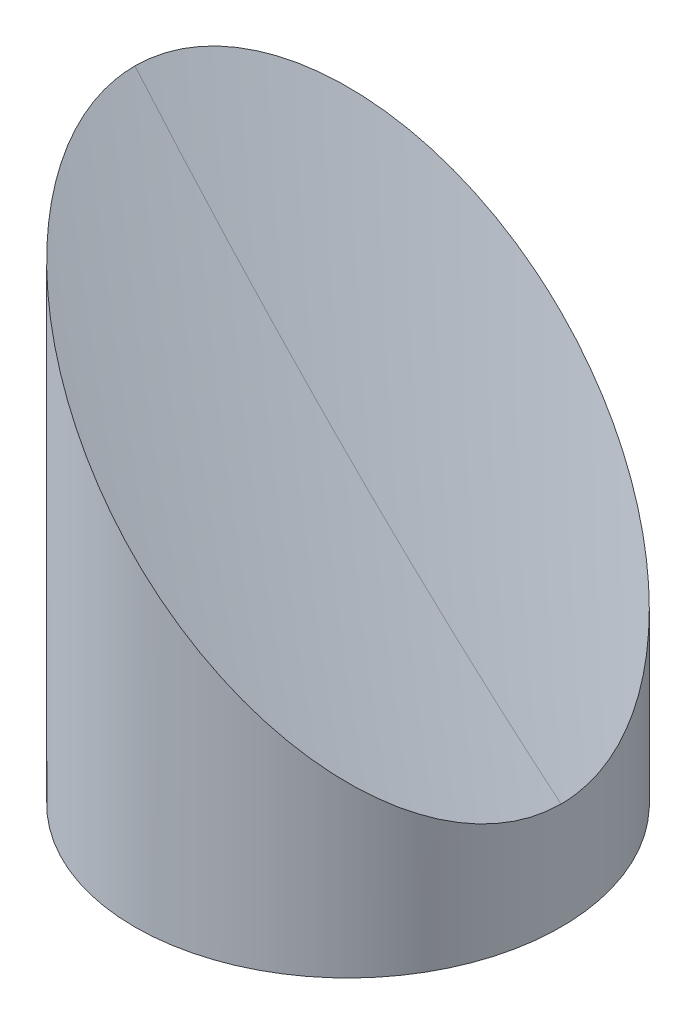
ISO-10303-21;
HEADER;
FILE_DESCRIPTION(('STEP AP214'),'2;1');
FILE_NAME('part.step','',(''),(''),'','','');
FILE_SCHEMA(('AUTOMOTIVE_DESIGN { 1 0 10303 214 1 1 1 1 }'));
ENDSEC;
DATA;
#1=APPLICATION_CONTEXT('core data for automotive mechanical design processes');
#2=APPLICATION_PROTOCOL_DEFINITION('international standard','automotive_design',2000,#1);
#3=PRODUCT_CONTEXT('',#1,'mechanical');
#4=PRODUCT('Part','Part','',(#3));
#5=PRODUCT_RELATED_PRODUCT_CATEGORY('part','',(#4));
#6=PRODUCT_DEFINITION_FORMATION('','',#4);
#7=PRODUCT_DEFINITION_CONTEXT('part definition',#1,'design');
#8=PRODUCT_DEFINITION('design','',#6,#7);
#9=PRODUCT_DEFINITION_SHAPE('','',#8);
#10=(LENGTH_UNIT() NAMED_UNIT(*) SI_UNIT(.MILLI.,.METRE.));
#11=(NAMED_UNIT(*) PLANE_ANGLE_UNIT() SI_UNIT($,.RADIAN.));
#12=(NAMED_UNIT(*) SI_UNIT($,.STERADIAN.) SOLID_ANGLE_UNIT());
#13=UNCERTAINTY_MEASURE_WITH_UNIT(LENGTH_MEASURE(1.E-05),#10,'distance_accuracy_value','');
#14=(GEOMETRIC_REPRESENTATION_CONTEXT(3) GLOBAL_UNCERTAINTY_ASSIGNED_CONTEXT((#13)) GLOBAL_UNIT_ASSIGNED_CONTEXT((#10,
#11,#12)) REPRESENTATION_CONTEXT('',''));
#15=CARTESIAN_POINT('',(0.,0.,0.));
#16=DIRECTION('',(0.,0.,1.));
#17=DIRECTION('',(1.,0.,0.));
#18=AXIS2_PLACEMENT_3D('',#15,#16,#17);
#19=CARTESIAN_POINT('',(9.525,4.32,0.));
#20=DIRECTION('',(0.,1.,0.));
#21=DIRECTION('',(0.,0.,1.));
#22=AXIS2_PLACEMENT_3D('',#19,#20,#21);
#23=PLANE('',#22);
#24=CARTESIAN_POINT('',(9.525,4.32,0.));
#25=DIRECTION('',(0.,-1.,0.));
#26=DIRECTION('',(0.,0.,-1.));
#27=AXIS2_PLACEMENT_3D('',#24,#25,#26);
#28=CIRCLE('',#27,1.594);
#29=CARTESIAN_POINT('',(9.525,4.32,-1.594));
#30=VERTEX_POINT('',#29);
#31=EDGE_CURVE('E20',#30,#30,#28,.T.);
#32=ORIENTED_EDGE('',*,*,#31,.T.);
#33=EDGE_LOOP('',(#32));
#34=FACE_BOUND('',#33,.T.);
#35=ADVANCED_FACE('F17',(#34),#23,.F.);
#36=CARTESIAN_POINT('',(0.,4.32,0.));
#37=DIRECTION('',(0.,1.,0.));
#38=DIRECTION('',(0.,0.,1.));
#39=AXIS2_PLACEMENT_3D('',#36,#37,#38);
#40=PLANE('',#39);
#41=CARTESIAN_POINT('',(0.,4.32,0.));
#42=DIRECTION('',(0.,-1.,0.));
#43=DIRECTION('',(0.,0.,-1.));
#44=AXIS2_PLACEMENT_3D('',#41,#42,#43);
#45=CIRCLE('',#44,1.594);
#46=CARTESIAN_POINT('',(0.,4.32,-1.594));
#47=VERTEX_POINT('',#46);
#48=EDGE_CURVE('E65',#47,#47,#45,.T.);
#49=ORIENTED_EDGE('',*,*,#48,.T.);
#50=EDGE_LOOP('',(#49));
#51=FACE_BOUND('',#50,.T.);
#52=ADVANCED_FACE('F129',(#51),#40,.F.);
#53=CARTESIAN_POINT('',(-9.525,6.1699999999405,0.));
#54=DIRECTION('',(0.,-1.,0.));
#55=DIRECTION('',(0.,0.,-1.));
#56=AXIS2_PLACEMENT_3D('',#53,#54,#55);
#57=CONICAL_SURFACE('',#56,1.35255000014922,1.02974425866422);
#58=CARTESIAN_POINT('',(-9.525,6.98269403028462,0.));
#59=VERTEX_POINT('',#58);
#60=VERTEX_LOOP('',#59);
#61=FACE_BOUND('',#60,.T.);
#62=CARTESIAN_POINT('',(-9.525,6.17,0.));
#63=DIRECTION('',(0.,-1.,0.));
#64=DIRECTION('',(0.,0.,-1.));
#65=AXIS2_PLACEMENT_3D('',#62,#63,#64);
#66=CIRCLE('',#65,1.35255);
#67=CARTESIAN_POINT('',(-9.525,6.17,-1.35255));
#68=VERTEX_POINT('',#67);
#69=EDGE_CURVE('E59',#68,#68,#66,.T.);
#70=ORIENTED_EDGE('',*,*,#69,.T.);
#71=EDGE_LOOP('',(#70));
#72=FACE_BOUND('',#71,.T.);
#73=ADVANCED_FACE('F126',(#61,#72),#57,.F.);
#74=CARTESIAN_POINT('',(4.76250000000001,6.17000000005419,8.24889197104677));
#75=DIRECTION('',(0.,-1.,0.));
#76=DIRECTION('',(0.,0.,-1.));
#77=AXIS2_PLACEMENT_3D('',#74,#75,#76);
#78=CONICAL_SURFACE('',#77,1.35254999986183,1.02974425844574);
#79=CARTESIAN_POINT('',(4.76250000000001,6.98269403039831,8.24889197113204));
#80=VERTEX_POINT('',#79);
#81=VERTEX_LOOP('',#80);
#82=FACE_BOUND('',#81,.T.);
#83=CARTESIAN_POINT('',(4.76250000000001,6.17,8.24889197104677));
#84=DIRECTION('',(0.,-1.,0.));
#85=DIRECTION('',(0.,0.,-1.));
#86=AXIS2_PLACEMENT_3D('',#83,#84,#85);
#87=CIRCLE('',#86,1.35255);
#88=CARTESIAN_POINT('',(4.76250000000001,6.17,6.89634197104677));
#89=VERTEX_POINT('',#88);
#90=EDGE_CURVE('E54',#89,#89,#87,.T.);
#91=ORIENTED_EDGE('',*,*,#90,.T.);
#92=EDGE_LOOP('',(#91));
#93=FACE_BOUND('',#92,.T.);
#94=ADVANCED_FACE('F48',(#82,#93),#78,.F.);
#95=CARTESIAN_POINT('',(4.76250000000001,6.16999999999734,-8.24889197104677));
#96=DIRECTION('',(0.,-1.,0.));
#97=DIRECTION('',(1.,0.,0.));
#98=AXIS2_PLACEMENT_3D('',#95,#96,#97);
#99=CONICAL_SURFACE('',#98,1.35254999992502,1.02974425866409);
#100=CARTESIAN_POINT('',(4.76250000000001,6.98269403019935,-8.24889197110362));
#101=VERTEX_POINT('',#100);
#102=VERTEX_LOOP('',#101);
#103=FACE_BOUND('',#102,.T.);
#104=CARTESIAN_POINT('',(4.76250000000001,6.17,-8.24889197104677));
#105=DIRECTION('',(0.,-1.,0.));
#106=DIRECTION('',(0.,0.,-1.));
#107=AXIS2_PLACEMENT_3D('',#104,#105,#106);
#108=CIRCLE('',#107,1.35255);
#109=CARTESIAN_POINT('',(4.76250000000001,6.17,-9.60144197104677));
#110=VERTEX_POINT('',#109);
#111=EDGE_CURVE('E52',#110,#110,#108,.T.);
#112=ORIENTED_EDGE('',*,*,#111,.T.);
#113=EDGE_LOOP('',(#112));
#114=FACE_BOUND('',#113,.T.);
#115=ADVANCED_FACE('F44',(#103,#114),#99,.F.);
#116=CARTESIAN_POINT('',(9.525,0.,0.));
#117=DIRECTION('',(0.,-1.,0.));
#118=DIRECTION('',(0.,0.,-1.));
#119=AXIS2_PLACEMENT_3D('',#116,#117,#118);
#120=CYLINDRICAL_SURFACE('',#119,1.594);
#121=ORIENTED_EDGE('',*,*,#31,.F.);
#122=EDGE_LOOP('',(#121));
#123=FACE_BOUND('',#122,.T.);
#124=CARTESIAN_POINT('',(9.525,0.,0.));
#125=DIRECTION('',(0.,-1.,0.));
#126=DIRECTION('',(0.,0.,-1.));
#127=AXIS2_PLACEMENT_3D('',#124,#125,#126);
#128=CIRCLE('',#127,1.594);
#129=CARTESIAN_POINT('',(9.525,0.,-1.594));
#130=VERTEX_POINT('',#129);
#131=EDGE_CURVE('E56',#130,#130,#128,.T.);
#132=ORIENTED_EDGE('',*,*,#131,.T.);
#133=EDGE_LOOP('',(#132));
#134=FACE_BOUND('',#133,.T.);
#135=ADVANCED_FACE('F47',(#123,#134),#120,.F.);
#136=CARTESIAN_POINT('',(0.,0.,0.));
#137=DIRECTION('',(0.,-1.,0.));
#138=DIRECTION('',(0.,0.,-1.));
#139=AXIS2_PLACEMENT_3D('',#136,#137,#138);
#140=CYLINDRICAL_SURFACE('',#139,1.594);
#141=ORIENTED_EDGE('',*,*,#48,.F.);
#142=EDGE_LOOP('',(#141));
#143=FACE_BOUND('',#142,.T.);
#144=CARTESIAN_POINT('',(0.,0.,0.));
#145=DIRECTION('',(0.,-1.,0.));
#146=DIRECTION('',(0.,0.,-1.));
#147=AXIS2_PLACEMENT_3D('',#144,#145,#146);
#148=CIRCLE('',#147,1.594);
#149=CARTESIAN_POINT('',(0.,0.,-1.594));
#150=VERTEX_POINT('',#149);
#151=EDGE_CURVE('E164',#150,#150,#148,.T.);
#152=ORIENTED_EDGE('',*,*,#151,.T.);
#153=EDGE_LOOP('',(#152));
#154=FACE_BOUND('',#153,.T.);
#155=ADVANCED_FACE('F116',(#143,#154),#140,.F.);
#156=CARTESIAN_POINT('',(-9.525,0.,0.));
#157=DIRECTION('',(0.,-1.,0.));
#158=DIRECTION('',(0.,0.,-1.));
#159=AXIS2_PLACEMENT_3D('',#156,#157,#158);
#160=CYLINDRICAL_SURFACE('',#159,1.35255);
#161=ORIENTED_EDGE('',*,*,#69,.F.);
#162=EDGE_LOOP('',(#161));
#163=FACE_BOUND('',#162,.T.);
#164=CARTESIAN_POINT('',(-9.525,0.,0.));
#165=DIRECTION('',(0.,-1.,0.));
#166=DIRECTION('',(0.,0.,-1.));
#167=AXIS2_PLACEMENT_3D('',#164,#165,#166);
#168=CIRCLE('',#167,1.35255);
#169=CARTESIAN_POINT('',(-9.525,0.,-1.35255));
#170=VERTEX_POINT('',#169);
#171=EDGE_CURVE('E160',#170,#170,#168,.T.);
#172=ORIENTED_EDGE('',*,*,#171,.T.);
#173=EDGE_LOOP('',(#172));
#174=FACE_BOUND('',#173,.T.);
#175=ADVANCED_FACE('F112',(#163,#174),#160,.F.);
#176=CARTESIAN_POINT('',(4.76250000000001,0.,8.24889197104677));
#177=DIRECTION('',(0.,-1.,0.));
#178=DIRECTION('',(0.,0.,-1.));
#179=AXIS2_PLACEMENT_3D('',#176,#177,#178);
#180=CYLINDRICAL_SURFACE('',#179,1.35255);
#181=ORIENTED_EDGE('',*,*,#90,.F.);
#182=EDGE_LOOP('',(#181));
#183=FACE_BOUND('',#182,.T.);
#184=CARTESIAN_POINT('',(4.76250000000001,0.,8.24889197104677));
#185=DIRECTION('',(0.,-1.,0.));
#186=DIRECTION('',(0.,0.,-1.));
#187=AXIS2_PLACEMENT_3D('',#184,#185,#186);
#188=CIRCLE('',#187,1.35255);
#189=CARTESIAN_POINT('',(4.76250000000001,0.,6.89634197104677));
#190=VERTEX_POINT('',#189);
#191=EDGE_CURVE('E156',#190,#190,#188,.T.);
#192=ORIENTED_EDGE('',*,*,#191,.T.);
#193=EDGE_LOOP('',(#192));
#194=FACE_BOUND('',#193,.T.);
#195=ADVANCED_FACE('F109',(#183,#194),#180,.F.);
#196=CARTESIAN_POINT('',(4.76250000000001,0.,-8.24889197104677));
#197=DIRECTION('',(0.,-1.,0.));
#198=DIRECTION('',(0.,0.,-1.));
#199=AXIS2_PLACEMENT_3D('',#196,#197,#198);
#200=CYLINDRICAL_SURFACE('',#199,1.35255);
#201=ORIENTED_EDGE('',*,*,#111,.F.);
#202=EDGE_LOOP('',(#201));
#203=FACE_BOUND('',#202,.T.);
#204=CARTESIAN_POINT('',(4.76250000000001,0.,-8.24889197104677));
#205=DIRECTION('',(0.,-1.,0.));
#206=DIRECTION('',(0.,0.,-1.));
#207=AXIS2_PLACEMENT_3D('',#204,#205,#206);
#208=CIRCLE('',#207,1.35255);
#209=CARTESIAN_POINT('',(4.76250000000001,0.,-9.60144197104677));
#210=VERTEX_POINT('',#209);
#211=EDGE_CURVE('E152',#210,#210,#208,.T.);
#212=ORIENTED_EDGE('',*,*,#211,.T.);
#213=EDGE_LOOP('',(#212));
#214=FACE_BOUND('',#213,.T.);
#215=ADVANCED_FACE('F101',(#203,#214),#200,.F.);
#216=CARTESIAN_POINT('',(-11.537222945202,31.9279524000273,15.2482672990668));
#217=CARTESIAN_POINT('',(-12.4129239047402,31.9279524000273,10.209559043668));
#218=CARTESIAN_POINT('',(-12.8523999999994,31.9279524000273,5.1142382671853));
#219=CARTESIAN_POINT('',(-12.8523999999993,31.9279524000273,-1.74339709335669E-12));
#220=CARTESIAN_POINT('',(1.12536542053467,16.9077809333549,13.0475761258415));
#221=CARTESIAN_POINT('',(0.376049140268043,16.9077809333549,8.73607448117627));
#222=CARTESIAN_POINT('',(6.92575027709755E-13,16.9077809333549,4.37613086182429));
#223=CARTESIAN_POINT('',(7.7715611723761E-13,16.9077809333549,-1.47278023110431E-12));
#224=CARTESIAN_POINT('',(13.7879537862713,6.22315240001751,10.8468849526163));
#225=CARTESIAN_POINT('',(13.1650221852763,6.22315240001751,7.26258991868454));
#226=CARTESIAN_POINT('',(12.8524000000007,6.22315240001751,3.63802345646327));
#227=CARTESIAN_POINT('',(12.8524000000008,6.22315240001751,-1.20216336885193E-12));
#228=(BOUNDED_SURFACE() B_SPLINE_SURFACE(2,3,((#216,#217,#218,#219),(#220,#221,#222,#223),(#224,
#225,#226,#227)),.UNSPECIFIED.,.F.,.F.,.F.) B_SPLINE_SURFACE_WITH_KNOTS((3,3),(4,4),
(0.496393190962452,0.497434289292743),(0.,1.),
.UNSPECIFIED.) GEOMETRIC_REPRESENTATION_ITEM() RATIONAL_B_SPLINE_SURFACE(((1.,0.997534009991186,
0.997534009991186,1.),(1.,0.997534009991186,0.997534009991186,1.),(1.,0.997534009991186,
0.997534009991186,1.))) REPRESENTATION_ITEM('') SURFACE());
#229=CARTESIAN_POINT('',(12.7000000000003,6.35000000001804,-2.40918709652745E-13));
#230=CARTESIAN_POINT('',(12.7000017011063,6.34999829939632,0.135684319517376));
#231=CARTESIAN_POINT('',(12.697824968645,6.35217503169324,0.271349485597933));
#232=CARTESIAN_POINT('',(12.6891366451376,6.3608633545507,0.542394958756967));
#233=CARTESIAN_POINT('',(12.6826252808029,6.36737471839975,0.677775280362013));
#234=CARTESIAN_POINT('',(12.656637226705,6.3933627720219,1.0829016606215));
#235=CARTESIAN_POINT('',(12.6307064947289,6.41929350498668,1.35187379328934));
#236=CARTESIAN_POINT('',(12.5623957304711,6.48760426984755,1.88349381224683));
#237=CARTESIAN_POINT('',(12.5201386476142,6.52986135232896,2.14617374181082));
#238=CARTESIAN_POINT('',(12.4199443961709,6.63005560358886,2.66550556707158));
#239=CARTESIAN_POINT('',(12.3620053417748,6.68799465817719,2.92215673375275));
#240=CARTESIAN_POINT('',(12.2316136459628,6.8183863541204,3.42716649719638));
#241=CARTESIAN_POINT('',(12.159200267214,6.89079973280888,3.67554545139419));
#242=CARTESIAN_POINT('',(12.0008408041084,7.04915919587864,4.16361365220217));
#243=CARTESIAN_POINT('',(11.9148891545327,7.13511084547886,4.40329927514793));
#244=CARTESIAN_POINT('',(11.7305003051669,7.31949969485869,4.87331419404003));
#245=CARTESIAN_POINT('',(11.6320443778909,7.41795562212416,5.10362875746726));
#246=CARTESIAN_POINT('',(11.423909349768,7.62609065024283,5.55390368303917));
#247=CARTESIAN_POINT('',(11.3142277619288,7.73577223808837,5.77386173491965));
#248=CARTESIAN_POINT('',(11.0342510430316,8.01574895699008,6.29746576760374));
#249=CARTESIAN_POINT('',(10.8585266090112,8.19147339100403,6.59533128151021));
#250=CARTESIAN_POINT('',(10.4892616079405,8.5607383920744,7.1680962824348));
#251=CARTESIAN_POINT('',(10.2957146646945,8.75428533532638,7.44298748252382));
#252=CARTESIAN_POINT('',(9.8932554571608,9.15674454285682,7.97017201462246));
#253=CARTESIAN_POINT('',(9.68431845608143,9.36568154392686,8.2224274538794));
#254=CARTESIAN_POINT('',(9.25376422005097,9.79623577995811,8.70415000742102));
#255=CARTESIAN_POINT('',(9.03214676471743,10.0178532353017,8.93361672545493));
#256=CARTESIAN_POINT('',(8.49068987777977,10.5593101222401,9.45455770225708));
#257=CARTESIAN_POINT('',(8.1659262214975,10.8840737785039,9.73582571165568));
#258=CARTESIAN_POINT('',(7.5003271598768,11.5496728401282,10.257385762454));
#259=CARTESIAN_POINT('',(7.15948560868818,11.890514391339,10.4976619698436));
#260=CARTESIAN_POINT('',(6.46518056264116,12.5848194373727,10.9389532419134));
#261=CARTESIAN_POINT('',(6.11171110166377,12.9382888983146,11.1399494504807));
#262=CARTESIAN_POINT('',(5.3952345420147,13.6547654579627,11.504038757329));
#263=CARTESIAN_POINT('',(5.03222836458131,14.0177716354306,11.6671355017888));
#264=CARTESIAN_POINT('',(4.28669922301091,14.7633007770202,11.9616131681826));
#265=CARTESIAN_POINT('',(3.90393028813246,15.1460697118816,12.0917445377867));
#266=CARTESIAN_POINT('',(3.13294073117828,15.9170592688312,12.3140426090714));
#267=CARTESIAN_POINT('',(2.74471999432213,16.3052800056997,12.4062085101967));
#268=CARTESIAN_POINT('',(1.96461579671055,17.0853842033122,12.5534019921638));
#269=CARTESIAN_POINT('',(1.57273084382357,17.4772691561876,12.6084137100659));
#270=CARTESIAN_POINT('',(0.78724061146337,18.2627593885558,12.6817135085025));
#271=CARTESIAN_POINT('',(0.393635201146762,18.6563647988919,12.6999987454611));
#272=CARTESIAN_POINT('',(-0.488910704372117,19.5389107043762,12.7000015581876));
#273=CARTESIAN_POINT('',(-0.977867365975158,20.0278673659062,12.6717970820766));
#274=CARTESIAN_POINT('',(-1.95261147378495,21.002611473727,12.5585872548674));
#275=CARTESIAN_POINT('',(-2.43839806163658,21.4883980616626,12.4735671157922));
#276=CARTESIAN_POINT('',(-3.40301609320207,22.4530160932247,12.2456133050626));
#277=CARTESIAN_POINT('',(-3.8818496011307,22.931849601066,12.1026972012472));
#278=CARTESIAN_POINT('',(-4.82852880764529,23.8785288075746,11.7570871237906));
#279=CARTESIAN_POINT('',(-5.29637916798144,24.3463791679921,11.5544190256643));
#280=CARTESIAN_POINT('',(-6.07820209930185,25.1282020993377,11.1568751475923));
#281=CARTESIAN_POINT('',(-6.39624295533966,25.4462429553532,10.9778914974675));
#282=CARTESIAN_POINT('',(-7.02251406233006,26.0725140623369,10.5882152467273));
#283=CARTESIAN_POINT('',(-7.33074470837117,26.3807447083936,10.3775239250438));
#284=CARTESIAN_POINT('',(-7.93448131571373,26.9844813157437,9.92353207290696));
#285=CARTESIAN_POINT('',(-8.23000339458917,27.2800033946111,9.68027455862056));
#286=CARTESIAN_POINT('',(-8.80567016334975,27.8556701633704,9.15973145153569));
#287=CARTESIAN_POINT('',(-9.08581930748704,28.1358193075143,8.88245579152337));
#288=CARTESIAN_POINT('',(-9.55687233925901,28.6068723392853,8.3692340801179));
#289=CARTESIAN_POINT('',(-9.75209276754894,28.8020927675709,8.14119328334526));
#290=CARTESIAN_POINT('',(-10.1302585965249,29.1802585965475,7.66551745095414));
#291=CARTESIAN_POINT('',(-10.3132045823595,29.3632045823869,7.41788335061793));
#292=CARTESIAN_POINT('',(-10.6645907690619,29.714590769089,6.90315370175983));
#293=CARTESIAN_POINT('',(-10.8330427331089,29.8830427331308,6.63607426617485));
#294=CARTESIAN_POINT('',(-11.1532332972319,30.203233297256,6.08256034394121));
#295=CARTESIAN_POINT('',(-11.3049757465951,30.3549757466264,5.79613033962069));
#296=CARTESIAN_POINT('',(-11.5604367059042,30.6104367059284,5.26448896252024));
#297=CARTESIAN_POINT('',(-11.6676635062465,30.7176635062603,5.02264366231438));
#298=CARTESIAN_POINT('',(-11.8684313393875,30.9184313394032,4.5278662420888));
#299=CARTESIAN_POINT('',(-11.9619755017789,31.0119755018068,4.27493667459826));
#300=CARTESIAN_POINT('',(-12.1338392171315,31.1838392171593,3.75947140966074));
#301=CARTESIAN_POINT('',(-12.2121860834215,31.2621860834371,3.49695397264084));
#302=CARTESIAN_POINT('',(-12.3525206132004,31.4025206132168,2.96332349313227));
#303=CARTESIAN_POINT('',(-12.4145121818311,31.4645121818606,2.69221251986443));
#304=CARTESIAN_POINT('',(-12.5058242477392,31.5558242477655,2.22135360234005));
#305=CARTESIAN_POINT('',(-12.5394220647089,31.5894220647263,2.02324625351194));
#306=CARTESIAN_POINT('',(-12.5973040144483,31.6473040144719,1.62435597620031));
#307=CARTESIAN_POINT('',(-12.6215901722825,31.6715901723212,1.42357363930254));
#308=CARTESIAN_POINT('',(-12.660643439706,31.7106434397234,1.01951125328955));
#309=CARTESIAN_POINT('',(-12.6753799408538,31.7253799408346,0.816225280214549));
#310=CARTESIAN_POINT('',(-12.6950699881426,31.7450699880922,0.408630021814922));
#311=CARTESIAN_POINT('',(-12.700019723441,31.7500197233958,0.204320368914465));
#312=CARTESIAN_POINT('',(-12.7000000000001,31.7500000000282,-1.12274406267449E-12));
#313=B_SPLINE_CURVE_WITH_KNOTS('',3,(#229,#230,#231,#232,#233,#234,#235,#236,#237,#238,#239,
#240,#241,#242,#243,#244,#245,#246,#247,#248,#249,#250,#251,#252,#253,#254,#255,#256,#257,#258,
#259,#260,#261,#262,#263,#264,#265,#266,#267,#268,#269,#270,#271,#272,#273,#274,#275,#276,#277,
#278,#279,#280,#281,#282,#283,#284,#285,#286,#287,#288,#289,#290,#291,#292,#293,#294,#295,#296,
#297,#298,#299,#300,#301,#302,#303,#304,#305,#306,#307,#308,#309,#310,#311,#312),.UNSPECIFIED.,
.F.,.F.,(4,2,2,2,2,2,2,2,2,2,2,2,2,2,2,2,2,2,2,2,2,2,2,2,2,2,2,2,2,2,2,2,2,2,2,2,2,2,2,2,2,4),
(0.,0.406980210497207,0.813939136638885,1.62713767851625,2.43432798932028,3.24161541063028,
4.04674201844721,4.85220046009061,5.65887977450513,6.46573819338188,7.6277558241921,
8.79019080663074,9.95453677773315,11.1189029909644,12.7322240661567,14.3461669189897,
15.9608826418714,17.5754429540626,19.2442438285103,20.9130798901659,22.5826280099686,
24.252305390825,26.3261116509384,28.4004578915488,30.4741751674738,32.5469957388624,
33.9981578300885,35.4492614042355,36.8984668098576,38.3472500719078,39.420661205837,
40.4940211315864,41.5665015483373,42.6387343840035,43.4943078929027,44.3496854017472,
45.203511042973,46.0571326320233,46.667903129417,47.2785407233074,47.8911259695614,
48.5039497018188),.UNSPECIFIED.);
#314=CARTESIAN_POINT('',(12.7,6.35000000001804,-1.20459354826373E-13));
#315=VERTEX_POINT('',#314);
#316=CARTESIAN_POINT('',(-12.7000000000001,31.7500000000274,-5.5029975141369E-13));
#317=VERTEX_POINT('',#316);
#318=EDGE_CURVE('E74',#315,#317,#313,.T.);
#319=CARTESIAN_POINT('',(-12.8523999999999,31.9279524000273,0.));
#320=CARTESIAN_POINT('',(1.59594559789866E-13,16.9077809333549,0.));
#321=CARTESIAN_POINT('',(12.8524000000002,6.22315240001751,0.));
#322=B_SPLINE_CURVE_WITH_KNOTS('',2,(#319,#320,#321),.UNSPECIFIED.,.F.,.F.,(3,3),
(0.496393190962452,0.497434289292743),.UNSPECIFIED.);
#323=EDGE_CURVE('E32',#317,#315,#322,.T.);
#324=ORIENTED_EDGE('',*,*,#318,.F.);
#325=ORIENTED_EDGE('',*,*,#323,.F.);
#326=EDGE_LOOP('',(#324,#325));
#327=FACE_BOUND('',#326,.T.);
#328=ADVANCED_FACE('F89',(#327),#228,.T.);
#329=CARTESIAN_POINT('',(-12.8523999999999,31.9279524000273,0.));
#330=CARTESIAN_POINT('',(-12.8523999999999,31.9279524000273,-5.08264990810657));
#331=CARTESIAN_POINT('',(-12.4183228585521,31.9279524000273,-10.1467299947213));
#332=CARTESIAN_POINT('',(-11.5533404388287,31.9279524000273,-15.1552363091773));
#333=CARTESIAN_POINT('',(-11.5403239884121,31.9279524000273,-15.2306054411007));
#334=CARTESIAN_POINT('',(-11.5273075379955,31.9279524000273,-15.305974573024));
#335=CARTESIAN_POINT('',(-11.5142910875788,31.9279524000273,-15.3813437049474));
#336=CARTESIAN_POINT('',(1.59594559789866E-13,16.9077809333549,0.));
#337=CARTESIAN_POINT('',(1.59594559789866E-13,16.9077809333549,-4.34910146158577));
#338=CARTESIAN_POINT('',(0.371429385152286,16.9077809333549,-8.68231317289333));
#339=CARTESIAN_POINT('',(1.11157406831547,16.9077809333549,-12.9679717420228));
#340=CARTESIAN_POINT('',(1.12271193233426,16.9077809333549,-13.0324632981466));
#341=CARTESIAN_POINT('',(1.13384979635306,16.9077809333549,-13.0969548542704));
#342=CARTESIAN_POINT('',(1.14498766037186,16.9077809333549,-13.1614464103942));
#343=CARTESIAN_POINT('',(12.8524000000002,6.22315240001751,0.));
#344=CARTESIAN_POINT('',(12.8524000000002,6.22315240001751,-3.61555301506497));
#345=CARTESIAN_POINT('',(13.1611816288567,6.22315240001751,-7.21789635106532));
#346=CARTESIAN_POINT('',(13.7764885754597,6.22315240001751,-10.7807071748683));
#347=CARTESIAN_POINT('',(13.7857478530806,6.22315240001751,-10.8343211551925));
#348=CARTESIAN_POINT('',(13.7950071307016,6.22315240001751,-10.8879351355168));
#349=CARTESIAN_POINT('',(13.8042664083225,6.22315240001751,-10.941549115841));
#350=(BOUNDED_SURFACE() B_SPLINE_SURFACE(2,3,((#329,#330,#331,#332,#333,#334,#335),(#336,#337,
#338,#339,#340,#341,#342),(#343,#344,#345,#346,#347,#348,#349)),.UNSPECIFIED.,.F.,.F.,
.F.) B_SPLINE_SURFACE_WITH_KNOTS((3,3),(4,3,4),(0.496393190962452,0.497434289292743),(0.,1.,
1.01508496806351),.UNSPECIFIED.) GEOMETRIC_REPRESENTATION_ITEM() RATIONAL_B_SPLINE_SURFACE(((1.,
0.99756428610698,0.99756428610698,1.,1.,1.,1.),(1.,0.99756428610698,0.99756428610698,1.,1.,1.,
1.),(1.,0.99756428610698,0.99756428610698,1.,1.,1.,1.))) REPRESENTATION_ITEM('') SURFACE());
#351=CARTESIAN_POINT('',(-12.700000000001,31.7500000000282,-1.10059950282738E-12));
#352=CARTESIAN_POINT('',(-12.7000020706972,31.750002071216,-0.142407966185273));
#353=CARTESIAN_POINT('',(-12.6976040042878,31.7476040046397,-0.284793781594083));
#354=CARTESIAN_POINT('',(-12.6880342807502,31.7380342804419,-0.569237167302523));
#355=CARTESIAN_POINT('',(-12.6808628658724,31.730862865071,-0.711294753892856));
#356=CARTESIAN_POINT('',(-12.6522480771682,31.7022480758844,-1.13627656481702));
#357=CARTESIAN_POINT('',(-12.6237040430099,31.6737040427313,-1.4183067520849));
#358=CARTESIAN_POINT('',(-12.5486147844174,31.5986147847482,-1.97497626478796));
#359=CARTESIAN_POINT('',(-12.5022246147507,31.5522246146976,-2.24965803338769));
#360=CARTESIAN_POINT('',(-12.3923608421941,31.4423608419538,-2.79212884538376));
#361=CARTESIAN_POINT('',(-12.3288847953059,31.3788847952624,-3.05991689668016));
#362=CARTESIAN_POINT('',(-12.1862353098594,31.236235309958,-3.58605081037512));
#363=CARTESIAN_POINT('',(-12.1071087717101,31.1571087717547,-3.84442221671521));
#364=CARTESIAN_POINT('',(-11.9343428331567,30.984342833163,-4.35122325696402));
#365=CARTESIAN_POINT('',(-11.8407039347588,30.8907039347809,-4.5996532343891));
#366=CARTESIAN_POINT('',(-11.640073160522,30.6900731605541,-5.08606342751087));
#367=CARTESIAN_POINT('',(-11.5330571078634,30.5830571078898,-5.32402364062416));
#368=CARTESIAN_POINT('',(-11.3070954591737,30.3570954591979,-5.78846621347123));
#369=CARTESIAN_POINT('',(-11.1881433915311,30.2381433915589,-6.01494224530948));
#370=CARTESIAN_POINT('',(-10.8889412677954,29.9389412678205,-6.54582856159135));
#371=CARTESIAN_POINT('',(-10.7034696633852,29.7534696633993,-6.84437539165488));
#372=CARTESIAN_POINT('',(-10.3147078578345,29.3647078578489,-7.41732905639119));
#373=CARTESIAN_POINT('',(-10.1114102147425,29.1614102147683,-7.69172571222661));
#374=CARTESIAN_POINT('',(-9.68954881388886,28.7395488139158,-8.21682613202534));
#375=CARTESIAN_POINT('',(-9.47096222662484,28.5209622266415,-8.4674930902222));
#376=CARTESIAN_POINT('',(-9.0212519489706,28.0712519489871,-8.94508899530715));
#377=CARTESIAN_POINT('',(-8.79012803565227,27.8401280356789,-9.17201751988827));
#378=CARTESIAN_POINT('',(-8.22599944537827,27.2759994454034,-9.68604956058359));
#379=CARTESIAN_POINT('',(-7.88813662108268,26.9381366210861,-9.96252218869824));
#380=CARTESIAN_POINT('',(-7.1966892967794,26.2466892967857,-10.4729378522588));
#381=CARTESIAN_POINT('',(-6.8430986456259,25.8930986456567,-10.7068640625309));
#382=CARTESIAN_POINT('',(-6.12375993154678,25.173759931566,-11.1339367158242));
#383=CARTESIAN_POINT('',(-5.75800879094594,24.8080087909291,-11.3270727429925));
#384=CARTESIAN_POINT('',(-5.01740027550145,24.067400275482,-11.674026349334));
#385=CARTESIAN_POINT('',(-4.64254421214044,23.6925442121546,-11.8278495548192));
#386=CARTESIAN_POINT('',(-3.91632884067033,22.9663288407037,-12.0867218179528));
#387=CARTESIAN_POINT('',(-3.56548506918499,22.6154850692077,-12.1946858164643));
#388=CARTESIAN_POINT('',(-2.85972611052239,21.9097261105404,-12.3792162199811));
#389=CARTESIAN_POINT('',(-2.50481116922113,21.5548111692451,-12.4557845109561));
#390=CARTESIAN_POINT('',(-1.79223994422206,20.8422399442449,-12.5780995611693));
#391=CARTESIAN_POINT('',(-1.43458291273084,20.4845829127467,-12.6238375866998));
#392=CARTESIAN_POINT('',(-0.717961915990456,19.7679619160136,-12.6847884281868));
#393=CARTESIAN_POINT('',(-0.358997839813562,19.408997839851,-12.6999985897819));
#394=CARTESIAN_POINT('',(0.4888090096691,18.5611909903332,-12.7000019201433));
#395=CARTESIAN_POINT('',(0.977680614958801,18.0723193849692,-12.6718077888543));
#396=CARTESIAN_POINT('',(1.95226940280165,17.097730597138,-12.5586379647086));
#397=CARTESIAN_POINT('',(2.43798557665814,16.6120144233676,-12.4736449376782));
#398=CARTESIAN_POINT('',(3.40262032182821,15.647379678189,-12.2457264689557));
#399=CARTESIAN_POINT('',(3.88153881492647,15.168461184996,-12.1028003612336));
#400=CARTESIAN_POINT('',(4.82837901877896,14.2216209811372,-11.7571520987594));
#401=CARTESIAN_POINT('',(5.29630551375351,13.753694486251,-11.5544564993009));
#402=CARTESIAN_POINT('',(6.07821250123284,12.9717874987986,-11.1568698431987));
#403=CARTESIAN_POINT('',(6.39626354357549,12.6537364564315,-10.9778799077146));
#404=CARTESIAN_POINT('',(7.02255502286951,12.0274449771298,-10.5881885397802));
#405=CARTESIAN_POINT('',(7.3307958324437,11.7192041675722,-10.3774883135299));
#406=CARTESIAN_POINT('',(7.93453120943823,11.1154687905851,-9.9234917250412));
#407=CARTESIAN_POINT('',(8.23004273124129,10.8199572687729,-9.68024061170417));
#408=CARTESIAN_POINT('',(8.80568912739462,10.2443108726178,-9.15971268112881));
#409=CARTESIAN_POINT('',(9.0858284642569,9.96417153576286,-8.88244581502956));
#410=CARTESIAN_POINT('',(9.55687106400389,9.49312893601421,-8.36923546953918));
#411=CARTESIAN_POINT('',(9.75209028541428,9.29790971459853,-8.14119618260696));
#412=CARTESIAN_POINT('',(10.1302538959301,8.91974610408317,-7.66552358642986));
#413=CARTESIAN_POINT('',(10.3131988683078,8.73680113171123,-7.41789120946894));
#414=CARTESIAN_POINT('',(10.6645854324001,8.38541456761805,-6.90316203017613));
#415=CARTESIAN_POINT('',(10.8330386078865,8.216961392125,-6.63608109506925));
#416=CARTESIAN_POINT('',(11.1532313947681,7.89676860524593,-6.08256393489985));
#417=CARTESIAN_POINT('',(11.3049748560493,7.74502514397383,-5.79613219286795));
#418=CARTESIAN_POINT('',(11.5604368362758,7.48956316373759,-5.26448869125466));
#419=CARTESIAN_POINT('',(11.6676637526454,7.3823362473545,-5.02264310660258));
#420=CARTESIAN_POINT('',(11.8684317846659,7.18156821533643,-4.52786509324419));
#421=CARTESIAN_POINT('',(11.9619760299602,7.08802397005812,-4.27493521710799));
#422=CARTESIAN_POINT('',(12.1338396761609,6.91616032385679,-3.75946990646638));
#423=CARTESIAN_POINT('',(12.2121864249032,6.837813575098,-3.49695275544741));
#424=CARTESIAN_POINT('',(12.3525207557611,6.69747924424122,-2.96332286979192));
#425=CARTESIAN_POINT('',(12.4145122430185,6.63548775700143,-2.69221220437554));
#426=CARTESIAN_POINT('',(12.5058242340555,6.5441757659598,-2.22135367286341));
#427=CARTESIAN_POINT('',(12.5394220405847,6.51057795941835,-2.02324639574752));
#428=CARTESIAN_POINT('',(12.5973039762662,6.45269602374544,-1.62435626333698));
#429=CARTESIAN_POINT('',(12.6215901304714,6.42840986956111,-1.42357399962476));
#430=CARTESIAN_POINT('',(12.6606434116318,6.38935658837106,-1.0195116162018));
#431=CARTESIAN_POINT('',(12.6753799232763,6.37462007667579,-0.816225571199455));
#432=CARTESIAN_POINT('',(12.6950699846214,6.35493001528715,-0.408630167848235));
#433=CARTESIAN_POINT('',(12.7000197234738,6.34998027644203,-0.204320441922875));
#434=CARTESIAN_POINT('',(12.6999999999992,6.35000000001804,-4.16569087441318E-13));
#435=B_SPLINE_CURVE_WITH_KNOTS('',3,(#351,#352,#353,#354,#355,#356,#357,#358,#359,#360,#361,
#362,#363,#364,#365,#366,#367,#368,#369,#370,#371,#372,#373,#374,#375,#376,#377,#378,#379,#380,
#381,#382,#383,#384,#385,#386,#387,#388,#389,#390,#391,#392,#393,#394,#395,#396,#397,#398,#399,
#400,#401,#402,#403,#404,#405,#406,#407,#408,#409,#410,#411,#412,#413,#414,#415,#416,#417,#418,
#419,#420,#421,#422,#423,#424,#425,#426,#427,#428,#429,#430,#431,#432,#433,#434),.UNSPECIFIED.,
.F.,.F.,(4,2,2,2,2,2,2,2,2,2,2,2,2,2,2,2,2,2,2,2,2,2,2,2,2,2,2,2,2,2,2,2,2,2,2,2,2,2,2,2,2,4),
(0.,0.427139825256087,0.85425797454407,1.70760715651096,2.55370368545916,3.39992130613133,
4.24364044173487,5.08733039822954,5.93256783896332,6.77826606266828,7.96869652471675,
9.15962635140285,10.3523740920425,11.5451430480696,13.1988077697248,14.8531250254367,
16.5078642049024,18.1623664311589,19.6846810872146,21.2069042829993,22.7295585185861,
24.2523451414102,26.3257610188649,28.3998099609959,30.47388274819,32.5470354198598,
33.9982444749277,35.4493983426684,36.8985555240097,38.3472897680588,39.4206940817946,
40.4940473511821,41.5665345237211,42.6387740779785,43.4943485692999,44.3497270576417,
45.2035517181266,46.057172326224,46.667942604462,47.2785799799071,47.891165444832,
48.5039893960178),.UNSPECIFIED.);
#436=EDGE_CURVE('E26',#317,#315,#435,.T.);
#437=ORIENTED_EDGE('',*,*,#323,.T.);
#438=ORIENTED_EDGE('',*,*,#436,.F.);
#439=EDGE_LOOP('',(#437,#438));
#440=FACE_BOUND('',#439,.T.);
#441=ADVANCED_FACE('F83',(#440),#350,.T.);
#442=CARTESIAN_POINT('',(0.,0.,0.));
#443=DIRECTION('',(0.,1.,0.));
#444=DIRECTION('',(0.,0.,1.));
#445=AXIS2_PLACEMENT_3D('',#442,#443,#444);
#446=PLANE('',#445);
#447=CARTESIAN_POINT('',(0.,0.,0.));
#448=DIRECTION('',(0.,-1.,0.));
#449=DIRECTION('',(0.,0.,-1.));
#450=AXIS2_PLACEMENT_3D('',#447,#448,#449);
#451=CIRCLE('',#450,12.7);
#452=CARTESIAN_POINT('',(0.,0.,-12.7));
#453=VERTEX_POINT('',#452);
#454=EDGE_CURVE('E10',#453,#453,#451,.F.);
#455=ORIENTED_EDGE('',*,*,#454,.F.);
#456=EDGE_LOOP('',(#455));
#457=FACE_BOUND('',#456,.T.);
#458=ORIENTED_EDGE('',*,*,#211,.F.);
#459=EDGE_LOOP('',(#458));
#460=FACE_BOUND('',#459,.T.);
#461=ORIENTED_EDGE('',*,*,#191,.F.);
#462=EDGE_LOOP('',(#461));
#463=FACE_BOUND('',#462,.T.);
#464=ORIENTED_EDGE('',*,*,#171,.F.);
#465=EDGE_LOOP('',(#464));
#466=FACE_BOUND('',#465,.T.);
#467=ORIENTED_EDGE('',*,*,#151,.F.);
#468=EDGE_LOOP('',(#467));
#469=FACE_BOUND('',#468,.T.);
#470=ORIENTED_EDGE('',*,*,#131,.F.);
#471=EDGE_LOOP('',(#470));
#472=FACE_BOUND('',#471,.T.);
#473=ADVANCED_FACE('F88',(#457,#460,#463,#466,#469,#472),#446,.F.);
#474=CARTESIAN_POINT('',(0.,200.,0.));
#475=DIRECTION('',(0.,-1.,0.));
#476=DIRECTION('',(0.,0.,-1.));
#477=AXIS2_PLACEMENT_3D('',#474,#475,#476);
#478=CYLINDRICAL_SURFACE('',#477,12.7);
#479=ORIENTED_EDGE('',*,*,#436,.T.);
#480=ORIENTED_EDGE('',*,*,#318,.T.);
#481=EDGE_LOOP('',(#479,#480));
#482=FACE_BOUND('',#481,.T.);
#483=ORIENTED_EDGE('',*,*,#454,.T.);
#484=EDGE_LOOP('',(#483));
#485=FACE_BOUND('',#484,.T.);
#486=ADVANCED_FACE('F80',(#482,#485),#478,.T.);
#487=CLOSED_SHELL('',(#35,#52,#73,#94,#115,#135,#155,#175,#195,#215,#328,#441,#473,#486));
#488=MANIFOLD_SOLID_BREP('B1',#487);
#489=ADVANCED_BREP_SHAPE_REPRESENTATION('',(#18,#488),#14);
#490=SHAPE_DEFINITION_REPRESENTATION(#9,#489);
ENDSEC;
END-ISO-10303-21;
